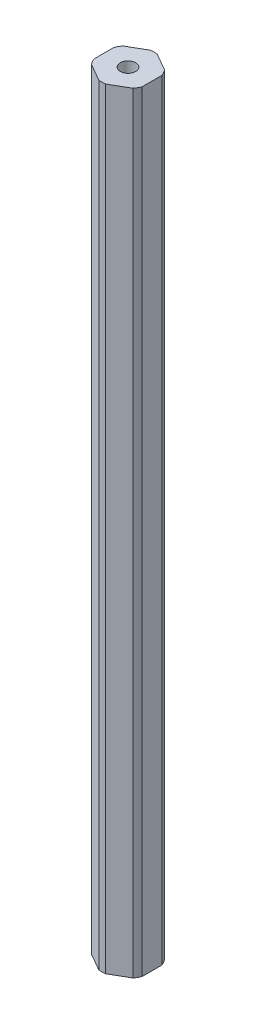
ISO-10303-21;
HEADER;
FILE_DESCRIPTION(('STEP AP214'),'2;1');
FILE_NAME('part.step','',(''),(''),'','','');
FILE_SCHEMA(('AUTOMOTIVE_DESIGN { 1 0 10303 214 1 1 1 1 }'));
ENDSEC;
DATA;
#1=APPLICATION_CONTEXT('core data for automotive mechanical design processes');
#2=APPLICATION_PROTOCOL_DEFINITION('international standard','automotive_design',2000,#1);
#3=PRODUCT_CONTEXT('',#1,'mechanical');
#4=PRODUCT('Part','Part','',(#3));
#5=PRODUCT_RELATED_PRODUCT_CATEGORY('part','',(#4));
#6=PRODUCT_DEFINITION_FORMATION('','',#4);
#7=PRODUCT_DEFINITION_CONTEXT('part definition',#1,'design');
#8=PRODUCT_DEFINITION('design','',#6,#7);
#9=PRODUCT_DEFINITION_SHAPE('','',#8);
#10=(LENGTH_UNIT() NAMED_UNIT(*) SI_UNIT(.MILLI.,.METRE.));
#11=(NAMED_UNIT(*) PLANE_ANGLE_UNIT() SI_UNIT($,.RADIAN.));
#12=(NAMED_UNIT(*) SI_UNIT($,.STERADIAN.) SOLID_ANGLE_UNIT());
#13=UNCERTAINTY_MEASURE_WITH_UNIT(LENGTH_MEASURE(1.E-05),#10,'distance_accuracy_value','');
#14=(GEOMETRIC_REPRESENTATION_CONTEXT(3) GLOBAL_UNCERTAINTY_ASSIGNED_CONTEXT((#13)) GLOBAL_UNIT_ASSIGNED_CONTEXT((#10,
#11,#12)) REPRESENTATION_CONTEXT('',''));
#15=CARTESIAN_POINT('',(0.,0.,0.));
#16=DIRECTION('',(0.,0.,1.));
#17=DIRECTION('',(1.,0.,0.));
#18=AXIS2_PLACEMENT_3D('',#15,#16,#17);
#19=CARTESIAN_POINT('',(0.,-101.6,0.));
#20=DIRECTION('',(0.,1.,0.));
#21=DIRECTION('',(0.,0.,1.));
#22=AXIS2_PLACEMENT_3D('',#19,#20,#21);
#23=CYLINDRICAL_SURFACE('',#22,6.875);
#24=CARTESIAN_POINT('',(0.,101.6,0.));
#25=DIRECTION('',(0.,-1.,0.));
#26=DIRECTION('',(0.,0.,-1.));
#27=AXIS2_PLACEMENT_3D('',#24,#25,#26);
#28=CIRCLE('',#27,6.875);
#29=CARTESIAN_POINT('',(5.45696050579321,101.6,-4.18177080173138));
#30=VERTEX_POINT('',#29);
#31=CARTESIAN_POINT('',(6.35,101.6,-2.63498102459961));
#32=VERTEX_POINT('',#31);
#33=EDGE_CURVE('E11',#30,#32,#28,.T.);
#34=ORIENTED_EDGE('',*,*,#33,.T.);
#35=DIRECTION('',(0.,1.,0.));
#36=VECTOR('',#35,1.);
#37=CARTESIAN_POINT('',(6.35,-101.6,-2.63498102459961));
#38=LINE('',#37,#36);
#39=CARTESIAN_POINT('',(6.35,-101.6,-2.63498102459961));
#40=VERTEX_POINT('',#39);
#41=EDGE_CURVE('E24',#40,#32,#38,.T.);
#42=ORIENTED_EDGE('',*,*,#41,.F.);
#43=CARTESIAN_POINT('',(0.,-101.6,0.));
#44=DIRECTION('',(0.,-1.,0.));
#45=DIRECTION('',(0.,0.,-1.));
#46=AXIS2_PLACEMENT_3D('',#43,#44,#45);
#47=CIRCLE('',#46,6.875);
#48=CARTESIAN_POINT('',(5.45696050579321,-101.6,-4.18177080173138));
#49=VERTEX_POINT('',#48);
#50=EDGE_CURVE('E203',#49,#40,#47,.T.);
#51=ORIENTED_EDGE('',*,*,#50,.F.);
#52=DIRECTION('',(0.,1.,0.));
#53=VECTOR('',#52,1.);
#54=CARTESIAN_POINT('',(5.45696050579321,-101.6,-4.18177080173138));
#55=LINE('',#54,#53);
#56=EDGE_CURVE('E117',#49,#30,#55,.T.);
#57=ORIENTED_EDGE('',*,*,#56,.T.);
#58=EDGE_LOOP('',(#34,#42,#51,#57));
#59=FACE_BOUND('',#58,.T.);
#60=ADVANCED_FACE('F17',(#59),#23,.T.);
#61=CARTESIAN_POINT('',(6.35,-101.6,0.));
#62=DIRECTION('',(-1.,0.,0.));
#63=DIRECTION('',(0.,0.,1.));
#64=AXIS2_PLACEMENT_3D('',#61,#62,#63);
#65=PLANE('',#64);
#66=DIRECTION('',(0.,0.,1.));
#67=VECTOR('',#66,1.);
#68=CARTESIAN_POINT('',(6.35,101.6,0.));
#69=LINE('',#68,#67);
#70=CARTESIAN_POINT('',(6.35,101.6,2.63498102459961));
#71=VERTEX_POINT('',#70);
#72=EDGE_CURVE('E200',#32,#71,#69,.T.);
#73=ORIENTED_EDGE('',*,*,#72,.T.);
#74=DIRECTION('',(0.,1.,0.));
#75=VECTOR('',#74,1.);
#76=CARTESIAN_POINT('',(6.35,-101.6,2.63498102459961));
#77=LINE('',#76,#75);
#78=CARTESIAN_POINT('',(6.35,-101.6,2.63498102459961));
#79=VERTEX_POINT('',#78);
#80=EDGE_CURVE('E197',#79,#71,#77,.T.);
#81=ORIENTED_EDGE('',*,*,#80,.F.);
#82=DIRECTION('',(0.,0.,1.));
#83=VECTOR('',#82,1.);
#84=CARTESIAN_POINT('',(6.35,-101.6,0.));
#85=LINE('',#84,#83);
#86=EDGE_CURVE('E194',#40,#79,#85,.T.);
#87=ORIENTED_EDGE('',*,*,#86,.F.);
#88=ORIENTED_EDGE('',*,*,#41,.T.);
#89=EDGE_LOOP('',(#73,#81,#87,#88));
#90=FACE_BOUND('',#89,.T.);
#91=ADVANCED_FACE('F206',(#90),#65,.F.);
#92=CARTESIAN_POINT('',(0.,-101.6,0.));
#93=DIRECTION('',(0.,1.,0.));
#94=DIRECTION('',(0.,0.,1.));
#95=AXIS2_PLACEMENT_3D('',#92,#93,#94);
#96=CYLINDRICAL_SURFACE('',#95,6.875);
#97=CARTESIAN_POINT('',(0.,101.6,0.));
#98=DIRECTION('',(0.,-1.,0.));
#99=DIRECTION('',(0.,0.,-1.));
#100=AXIS2_PLACEMENT_3D('',#97,#98,#99);
#101=CIRCLE('',#100,6.875);
#102=CARTESIAN_POINT('',(5.45696050579321,101.6,4.18177080173138));
#103=VERTEX_POINT('',#102);
#104=EDGE_CURVE('E192',#71,#103,#101,.T.);
#105=ORIENTED_EDGE('',*,*,#104,.T.);
#106=DIRECTION('',(0.,1.,0.));
#107=VECTOR('',#106,1.);
#108=CARTESIAN_POINT('',(5.45696050579321,-101.6,4.18177080173138));
#109=LINE('',#108,#107);
#110=CARTESIAN_POINT('',(5.45696050579321,-101.6,4.18177080173138));
#111=VERTEX_POINT('',#110);
#112=EDGE_CURVE('E189',#111,#103,#109,.T.);
#113=ORIENTED_EDGE('',*,*,#112,.F.);
#114=CARTESIAN_POINT('',(0.,-101.6,0.));
#115=DIRECTION('',(0.,-1.,0.));
#116=DIRECTION('',(0.,0.,-1.));
#117=AXIS2_PLACEMENT_3D('',#114,#115,#116);
#118=CIRCLE('',#117,6.875);
#119=EDGE_CURVE('E186',#79,#111,#118,.T.);
#120=ORIENTED_EDGE('',*,*,#119,.F.);
#121=ORIENTED_EDGE('',*,*,#80,.T.);
#122=EDGE_LOOP('',(#105,#113,#120,#121));
#123=FACE_BOUND('',#122,.T.);
#124=ADVANCED_FACE('F213',(#123),#96,.T.);
#125=CARTESIAN_POINT('',(3.175,-101.6,5.49926131403118));
#126=DIRECTION('',(-0.5,0.,-0.866025403784439));
#127=DIRECTION('',(-0.866025403784439,0.,0.5));
#128=AXIS2_PLACEMENT_3D('',#125,#126,#127);
#129=PLANE('',#128);
#130=DIRECTION('',(-0.866025403784439,0.,0.5));
#131=VECTOR('',#130,1.);
#132=CARTESIAN_POINT('',(3.175,101.6,5.49926131403118));
#133=LINE('',#132,#131);
#134=CARTESIAN_POINT('',(0.893039494206789,101.6,6.81675182633099));
#135=VERTEX_POINT('',#134);
#136=EDGE_CURVE('E184',#103,#135,#133,.T.);
#137=ORIENTED_EDGE('',*,*,#136,.T.);
#138=DIRECTION('',(0.,1.,0.));
#139=VECTOR('',#138,1.);
#140=CARTESIAN_POINT('',(0.893039494206789,-101.6,6.81675182633099));
#141=LINE('',#140,#139);
#142=CARTESIAN_POINT('',(0.893039494206789,-101.6,6.81675182633099));
#143=VERTEX_POINT('',#142);
#144=EDGE_CURVE('E181',#143,#135,#141,.T.);
#145=ORIENTED_EDGE('',*,*,#144,.F.);
#146=DIRECTION('',(-0.866025403784439,0.,0.5));
#147=VECTOR('',#146,1.);
#148=CARTESIAN_POINT('',(3.175,-101.6,5.49926131403118));
#149=LINE('',#148,#147);
#150=EDGE_CURVE('E178',#111,#143,#149,.T.);
#151=ORIENTED_EDGE('',*,*,#150,.F.);
#152=ORIENTED_EDGE('',*,*,#112,.T.);
#153=EDGE_LOOP('',(#137,#145,#151,#152));
#154=FACE_BOUND('',#153,.T.);
#155=ADVANCED_FACE('F217',(#154),#129,.F.);
#156=CARTESIAN_POINT('',(0.,-101.6,0.));
#157=DIRECTION('',(0.,1.,0.));
#158=DIRECTION('',(0.,0.,1.));
#159=AXIS2_PLACEMENT_3D('',#156,#157,#158);
#160=CYLINDRICAL_SURFACE('',#159,6.875);
#161=CARTESIAN_POINT('',(0.,101.6,0.));
#162=DIRECTION('',(0.,-1.,0.));
#163=DIRECTION('',(0.,0.,-1.));
#164=AXIS2_PLACEMENT_3D('',#161,#162,#163);
#165=CIRCLE('',#164,6.875);
#166=CARTESIAN_POINT('',(-0.893039494206811,101.6,6.81675182633099));
#167=VERTEX_POINT('',#166);
#168=EDGE_CURVE('E176',#135,#167,#165,.T.);
#169=ORIENTED_EDGE('',*,*,#168,.T.);
#170=DIRECTION('',(0.,1.,0.));
#171=VECTOR('',#170,1.);
#172=CARTESIAN_POINT('',(-0.893039494206811,-101.6,6.81675182633099));
#173=LINE('',#172,#171);
#174=CARTESIAN_POINT('',(-0.893039494206811,-101.6,6.81675182633099));
#175=VERTEX_POINT('',#174);
#176=EDGE_CURVE('E173',#175,#167,#173,.T.);
#177=ORIENTED_EDGE('',*,*,#176,.F.);
#178=CARTESIAN_POINT('',(0.,-101.6,0.));
#179=DIRECTION('',(0.,-1.,0.));
#180=DIRECTION('',(0.,0.,-1.));
#181=AXIS2_PLACEMENT_3D('',#178,#179,#180);
#182=CIRCLE('',#181,6.875);
#183=EDGE_CURVE('E170',#143,#175,#182,.T.);
#184=ORIENTED_EDGE('',*,*,#183,.F.);
#185=ORIENTED_EDGE('',*,*,#144,.T.);
#186=EDGE_LOOP('',(#169,#177,#184,#185));
#187=FACE_BOUND('',#186,.T.);
#188=ADVANCED_FACE('F248',(#187),#160,.T.);
#189=CARTESIAN_POINT('',(-3.175,-101.6,5.49926131403119));
#190=DIRECTION('',(0.5,0.,-0.866025403784439));
#191=DIRECTION('',(-0.866025403784439,0.,-0.5));
#192=AXIS2_PLACEMENT_3D('',#189,#190,#191);
#193=PLANE('',#192);
#194=DIRECTION('',(-0.866025403784439,0.,-0.5));
#195=VECTOR('',#194,1.);
#196=CARTESIAN_POINT('',(-3.175,101.6,5.49926131403119));
#197=LINE('',#196,#195);
#198=CARTESIAN_POINT('',(-5.4569605057932,101.6,4.1817708017314));
#199=VERTEX_POINT('',#198);
#200=EDGE_CURVE('E168',#167,#199,#197,.T.);
#201=ORIENTED_EDGE('',*,*,#200,.T.);
#202=DIRECTION('',(0.,1.,0.));
#203=VECTOR('',#202,1.);
#204=CARTESIAN_POINT('',(-5.4569605057932,-101.6,4.1817708017314));
#205=LINE('',#204,#203);
#206=CARTESIAN_POINT('',(-5.4569605057932,-101.6,4.1817708017314));
#207=VERTEX_POINT('',#206);
#208=EDGE_CURVE('E165',#207,#199,#205,.T.);
#209=ORIENTED_EDGE('',*,*,#208,.F.);
#210=DIRECTION('',(-0.866025403784439,0.,-0.5));
#211=VECTOR('',#210,1.);
#212=CARTESIAN_POINT('',(-3.175,-101.6,5.49926131403119));
#213=LINE('',#212,#211);
#214=EDGE_CURVE('E162',#175,#207,#213,.T.);
#215=ORIENTED_EDGE('',*,*,#214,.F.);
#216=ORIENTED_EDGE('',*,*,#176,.T.);
#217=EDGE_LOOP('',(#201,#209,#215,#216));
#218=FACE_BOUND('',#217,.T.);
#219=ADVANCED_FACE('F251',(#218),#193,.F.);
#220=CARTESIAN_POINT('',(0.,-101.6,0.));
#221=DIRECTION('',(0.,1.,0.));
#222=DIRECTION('',(0.,0.,1.));
#223=AXIS2_PLACEMENT_3D('',#220,#221,#222);
#224=CYLINDRICAL_SURFACE('',#223,6.875);
#225=CARTESIAN_POINT('',(0.,101.6,0.));
#226=DIRECTION('',(0.,-1.,0.));
#227=DIRECTION('',(0.,0.,-1.));
#228=AXIS2_PLACEMENT_3D('',#225,#226,#227);
#229=CIRCLE('',#228,6.875);
#230=CARTESIAN_POINT('',(-6.35,101.6,2.6349810245996));
#231=VERTEX_POINT('',#230);
#232=EDGE_CURVE('E160',#199,#231,#229,.T.);
#233=ORIENTED_EDGE('',*,*,#232,.T.);
#234=DIRECTION('',(0.,1.,0.));
#235=VECTOR('',#234,1.);
#236=CARTESIAN_POINT('',(-6.35,-101.6,2.6349810245996));
#237=LINE('',#236,#235);
#238=CARTESIAN_POINT('',(-6.35,-101.6,2.6349810245996));
#239=VERTEX_POINT('',#238);
#240=EDGE_CURVE('E157',#239,#231,#237,.T.);
#241=ORIENTED_EDGE('',*,*,#240,.F.);
#242=CARTESIAN_POINT('',(0.,-101.6,0.));
#243=DIRECTION('',(0.,-1.,0.));
#244=DIRECTION('',(0.,0.,-1.));
#245=AXIS2_PLACEMENT_3D('',#242,#243,#244);
#246=CIRCLE('',#245,6.875);
#247=EDGE_CURVE('E154',#207,#239,#246,.T.);
#248=ORIENTED_EDGE('',*,*,#247,.F.);
#249=ORIENTED_EDGE('',*,*,#208,.T.);
#250=EDGE_LOOP('',(#233,#241,#248,#249));
#251=FACE_BOUND('',#250,.T.);
#252=ADVANCED_FACE('F255',(#251),#224,.T.);
#253=CARTESIAN_POINT('',(-6.35,-101.6,0.));
#254=DIRECTION('',(1.,0.,0.));
#255=DIRECTION('',(0.,0.,-1.));
#256=AXIS2_PLACEMENT_3D('',#253,#254,#255);
#257=PLANE('',#256);
#258=DIRECTION('',(0.,0.,-1.));
#259=VECTOR('',#258,1.);
#260=CARTESIAN_POINT('',(-6.35,101.6,0.));
#261=LINE('',#260,#259);
#262=CARTESIAN_POINT('',(-6.35,101.6,-2.6349810245996));
#263=VERTEX_POINT('',#262);
#264=EDGE_CURVE('E152',#231,#263,#261,.T.);
#265=ORIENTED_EDGE('',*,*,#264,.T.);
#266=DIRECTION('',(0.,1.,0.));
#267=VECTOR('',#266,1.);
#268=CARTESIAN_POINT('',(-6.35,-101.6,-2.6349810245996));
#269=LINE('',#268,#267);
#270=CARTESIAN_POINT('',(-6.35,-101.6,-2.6349810245996));
#271=VERTEX_POINT('',#270);
#272=EDGE_CURVE('E149',#271,#263,#269,.T.);
#273=ORIENTED_EDGE('',*,*,#272,.F.);
#274=DIRECTION('',(0.,0.,-1.));
#275=VECTOR('',#274,1.);
#276=CARTESIAN_POINT('',(-6.35,-101.6,0.));
#277=LINE('',#276,#275);
#278=EDGE_CURVE('E146',#239,#271,#277,.T.);
#279=ORIENTED_EDGE('',*,*,#278,.F.);
#280=ORIENTED_EDGE('',*,*,#240,.T.);
#281=EDGE_LOOP('',(#265,#273,#279,#280));
#282=FACE_BOUND('',#281,.T.);
#283=ADVANCED_FACE('F259',(#282),#257,.F.);
#284=CARTESIAN_POINT('',(0.,-101.6,0.));
#285=DIRECTION('',(0.,1.,0.));
#286=DIRECTION('',(0.,0.,1.));
#287=AXIS2_PLACEMENT_3D('',#284,#285,#286);
#288=CYLINDRICAL_SURFACE('',#287,6.875);
#289=CARTESIAN_POINT('',(0.,101.6,0.));
#290=DIRECTION('',(0.,-1.,0.));
#291=DIRECTION('',(0.,0.,-1.));
#292=AXIS2_PLACEMENT_3D('',#289,#290,#291);
#293=CIRCLE('',#292,6.875);
#294=CARTESIAN_POINT('',(-5.45696050579321,101.6,-4.18177080173138));
#295=VERTEX_POINT('',#294);
#296=EDGE_CURVE('E144',#263,#295,#293,.T.);
#297=ORIENTED_EDGE('',*,*,#296,.T.);
#298=DIRECTION('',(0.,1.,0.));
#299=VECTOR('',#298,1.);
#300=CARTESIAN_POINT('',(-5.45696050579321,-101.6,-4.18177080173138));
#301=LINE('',#300,#299);
#302=CARTESIAN_POINT('',(-5.45696050579321,-101.6,-4.18177080173138));
#303=VERTEX_POINT('',#302);
#304=EDGE_CURVE('E141',#303,#295,#301,.T.);
#305=ORIENTED_EDGE('',*,*,#304,.F.);
#306=CARTESIAN_POINT('',(0.,-101.6,0.));
#307=DIRECTION('',(0.,-1.,0.));
#308=DIRECTION('',(0.,0.,-1.));
#309=AXIS2_PLACEMENT_3D('',#306,#307,#308);
#310=CIRCLE('',#309,6.875);
#311=EDGE_CURVE('E139',#271,#303,#310,.T.);
#312=ORIENTED_EDGE('',*,*,#311,.F.);
#313=ORIENTED_EDGE('',*,*,#272,.T.);
#314=EDGE_LOOP('',(#297,#305,#312,#313));
#315=FACE_BOUND('',#314,.T.);
#316=ADVANCED_FACE('F263',(#315),#288,.T.);
#317=CARTESIAN_POINT('',(-3.175,-101.6,-5.49926131403119));
#318=DIRECTION('',(0.5,0.,0.866025403784438));
#319=DIRECTION('',(0.866025403784439,0.,-0.5));
#320=AXIS2_PLACEMENT_3D('',#317,#318,#319);
#321=PLANE('',#320);
#322=DIRECTION('',(0.866025403784439,0.,-0.5));
#323=VECTOR('',#322,1.);
#324=CARTESIAN_POINT('',(-3.175,101.6,-5.49926131403119));
#325=LINE('',#324,#323);
#326=CARTESIAN_POINT('',(-0.893039494206805,101.6,-6.81675182633099));
#327=VERTEX_POINT('',#326);
#328=EDGE_CURVE('E137',#295,#327,#325,.T.);
#329=ORIENTED_EDGE('',*,*,#328,.T.);
#330=DIRECTION('',(0.,1.,0.));
#331=VECTOR('',#330,1.);
#332=CARTESIAN_POINT('',(-0.893039494206805,-101.6,-6.81675182633099));
#333=LINE('',#332,#331);
#334=CARTESIAN_POINT('',(-0.893039494206805,-101.6,-6.81675182633099));
#335=VERTEX_POINT('',#334);
#336=EDGE_CURVE('E135',#335,#327,#333,.T.);
#337=ORIENTED_EDGE('',*,*,#336,.F.);
#338=DIRECTION('',(0.866025403784439,0.,-0.5));
#339=VECTOR('',#338,1.);
#340=CARTESIAN_POINT('',(-3.175,-101.6,-5.49926131403119));
#341=LINE('',#340,#339);
#342=EDGE_CURVE('E125',#303,#335,#341,.T.);
#343=ORIENTED_EDGE('',*,*,#342,.F.);
#344=ORIENTED_EDGE('',*,*,#304,.T.);
#345=EDGE_LOOP('',(#329,#337,#343,#344));
#346=FACE_BOUND('',#345,.T.);
#347=ADVANCED_FACE('F234',(#346),#321,.F.);
#348=CARTESIAN_POINT('',(0.,-101.6,0.));
#349=DIRECTION('',(0.,1.,0.));
#350=DIRECTION('',(0.,0.,1.));
#351=AXIS2_PLACEMENT_3D('',#348,#349,#350);
#352=CYLINDRICAL_SURFACE('',#351,6.875);
#353=CARTESIAN_POINT('',(0.,101.6,0.));
#354=DIRECTION('',(0.,-1.,0.));
#355=DIRECTION('',(0.,0.,-1.));
#356=AXIS2_PLACEMENT_3D('',#353,#354,#355);
#357=CIRCLE('',#356,6.875);
#358=CARTESIAN_POINT('',(0.893039494206785,101.6,-6.81675182633099));
#359=VERTEX_POINT('',#358);
#360=EDGE_CURVE('E108',#327,#359,#357,.T.);
#361=ORIENTED_EDGE('',*,*,#360,.T.);
#362=DIRECTION('',(0.,1.,0.));
#363=VECTOR('',#362,1.);
#364=CARTESIAN_POINT('',(0.893039494206785,-101.6,-6.81675182633099));
#365=LINE('',#364,#363);
#366=CARTESIAN_POINT('',(0.893039494206785,-101.6,-6.81675182633099));
#367=VERTEX_POINT('',#366);
#368=EDGE_CURVE('E100',#367,#359,#365,.T.);
#369=ORIENTED_EDGE('',*,*,#368,.F.);
#370=CARTESIAN_POINT('',(0.,-101.6,0.));
#371=DIRECTION('',(0.,-1.,0.));
#372=DIRECTION('',(0.,0.,-1.));
#373=AXIS2_PLACEMENT_3D('',#370,#371,#372);
#374=CIRCLE('',#373,6.875);
#375=EDGE_CURVE('E105',#335,#367,#374,.T.);
#376=ORIENTED_EDGE('',*,*,#375,.F.);
#377=ORIENTED_EDGE('',*,*,#336,.T.);
#378=EDGE_LOOP('',(#361,#369,#376,#377));
#379=FACE_BOUND('',#378,.T.);
#380=ADVANCED_FACE('F102',(#379),#352,.T.);
#381=CARTESIAN_POINT('',(0.,-101.6,0.));
#382=DIRECTION('',(0.,1.,0.));
#383=DIRECTION('',(0.,0.,1.));
#384=AXIS2_PLACEMENT_3D('',#381,#382,#383);
#385=CYLINDRICAL_SURFACE('',#384,2.0193);
#386=CARTESIAN_POINT('',(0.,-101.6,0.));
#387=DIRECTION('',(0.,-1.,0.));
#388=DIRECTION('',(0.,0.,-1.));
#389=AXIS2_PLACEMENT_3D('',#386,#387,#388);
#390=CIRCLE('',#389,2.0193);
#391=CARTESIAN_POINT('',(0.,-101.6,-2.0193));
#392=VERTEX_POINT('',#391);
#393=EDGE_CURVE('E126',#392,#392,#390,.T.);
#394=ORIENTED_EDGE('',*,*,#393,.T.);
#395=EDGE_LOOP('',(#394));
#396=FACE_BOUND('',#395,.T.);
#397=CARTESIAN_POINT('',(0.,101.6,0.));
#398=DIRECTION('',(0.,-1.,0.));
#399=DIRECTION('',(0.,0.,-1.));
#400=AXIS2_PLACEMENT_3D('',#397,#398,#399);
#401=CIRCLE('',#400,2.0193);
#402=CARTESIAN_POINT('',(0.,101.6,-2.0193));
#403=VERTEX_POINT('',#402);
#404=EDGE_CURVE('E129',#403,#403,#401,.T.);
#405=ORIENTED_EDGE('',*,*,#404,.F.);
#406=EDGE_LOOP('',(#405));
#407=FACE_BOUND('',#406,.T.);
#408=ADVANCED_FACE('F224',(#396,#407),#385,.F.);
#409=CARTESIAN_POINT('',(3.175,-101.6,-5.49926131403118));
#410=DIRECTION('',(-0.5,0.,0.866025403784439));
#411=DIRECTION('',(0.866025403784439,0.,0.5));
#412=AXIS2_PLACEMENT_3D('',#409,#410,#411);
#413=PLANE('',#412);
#414=DIRECTION('',(0.866025403784439,0.,0.5));
#415=VECTOR('',#414,1.);
#416=CARTESIAN_POINT('',(3.175,101.6,-5.49926131403118));
#417=LINE('',#416,#415);
#418=EDGE_CURVE('E120',#359,#30,#417,.T.);
#419=ORIENTED_EDGE('',*,*,#418,.T.);
#420=ORIENTED_EDGE('',*,*,#56,.F.);
#421=DIRECTION('',(0.866025403784439,0.,0.5));
#422=VECTOR('',#421,1.);
#423=CARTESIAN_POINT('',(3.175,-101.6,-5.49926131403118));
#424=LINE('',#423,#422);
#425=EDGE_CURVE('E115',#367,#49,#424,.T.);
#426=ORIENTED_EDGE('',*,*,#425,.F.);
#427=ORIENTED_EDGE('',*,*,#368,.T.);
#428=EDGE_LOOP('',(#419,#420,#426,#427));
#429=FACE_BOUND('',#428,.T.);
#430=ADVANCED_FACE('F116',(#429),#413,.F.);
#431=CARTESIAN_POINT('',(0.,-101.6,0.));
#432=DIRECTION('',(0.,-1.,0.));
#433=DIRECTION('',(1.,0.,0.));
#434=AXIS2_PLACEMENT_3D('',#431,#432,#433);
#435=PLANE('',#434);
#436=ORIENTED_EDGE('',*,*,#393,.F.);
#437=EDGE_LOOP('',(#436));
#438=FACE_BOUND('',#437,.T.);
#439=ORIENTED_EDGE('',*,*,#50,.T.);
#440=ORIENTED_EDGE('',*,*,#86,.T.);
#441=ORIENTED_EDGE('',*,*,#119,.T.);
#442=ORIENTED_EDGE('',*,*,#150,.T.);
#443=ORIENTED_EDGE('',*,*,#183,.T.);
#444=ORIENTED_EDGE('',*,*,#214,.T.);
#445=ORIENTED_EDGE('',*,*,#247,.T.);
#446=ORIENTED_EDGE('',*,*,#278,.T.);
#447=ORIENTED_EDGE('',*,*,#311,.T.);
#448=ORIENTED_EDGE('',*,*,#342,.T.);
#449=ORIENTED_EDGE('',*,*,#375,.T.);
#450=ORIENTED_EDGE('',*,*,#425,.T.);
#451=EDGE_LOOP('',(#439,#440,#441,#442,#443,#444,#445,#446,#447,#448,#449,#450));
#452=FACE_BOUND('',#451,.T.);
#453=ADVANCED_FACE('F122',(#438,#452),#435,.T.);
#454=CARTESIAN_POINT('',(0.,101.6,0.));
#455=DIRECTION('',(0.,-1.,0.));
#456=DIRECTION('',(1.,0.,0.));
#457=AXIS2_PLACEMENT_3D('',#454,#455,#456);
#458=PLANE('',#457);
#459=ORIENTED_EDGE('',*,*,#404,.T.);
#460=EDGE_LOOP('',(#459));
#461=FACE_BOUND('',#460,.T.);
#462=ORIENTED_EDGE('',*,*,#33,.F.);
#463=ORIENTED_EDGE('',*,*,#418,.F.);
#464=ORIENTED_EDGE('',*,*,#360,.F.);
#465=ORIENTED_EDGE('',*,*,#328,.F.);
#466=ORIENTED_EDGE('',*,*,#296,.F.);
#467=ORIENTED_EDGE('',*,*,#264,.F.);
#468=ORIENTED_EDGE('',*,*,#232,.F.);
#469=ORIENTED_EDGE('',*,*,#200,.F.);
#470=ORIENTED_EDGE('',*,*,#168,.F.);
#471=ORIENTED_EDGE('',*,*,#136,.F.);
#472=ORIENTED_EDGE('',*,*,#104,.F.);
#473=ORIENTED_EDGE('',*,*,#72,.F.);
#474=EDGE_LOOP('',(#462,#463,#464,#465,#466,#467,#468,#469,#470,#471,#472,#473));
#475=FACE_BOUND('',#474,.T.);
#476=ADVANCED_FACE('F209',(#461,#475),#458,.F.);
#477=CLOSED_SHELL('',(#60,#91,#124,#155,#188,#219,#252,#283,#316,#347,#380,#408,#430,#453,#476));
#478=MANIFOLD_SOLID_BREP('B1',#477);
#479=ADVANCED_BREP_SHAPE_REPRESENTATION('',(#18,#478),#14);
#480=SHAPE_DEFINITION_REPRESENTATION(#9,#479);
ENDSEC;
END-ISO-10303-21;
